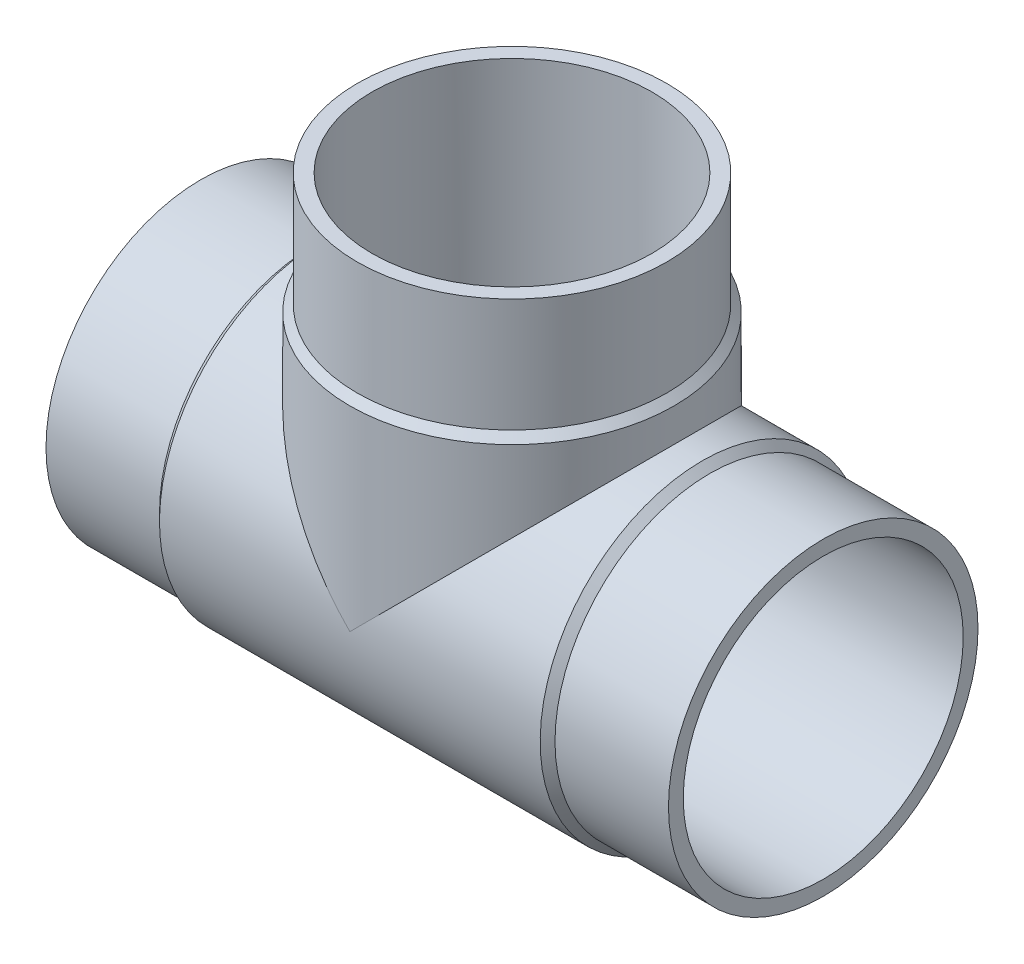
ISO-10303-21;
HEADER;
FILE_DESCRIPTION(('STEP AP214'),'2;1');
FILE_NAME('part.step','',(''),(''),'','','');
FILE_SCHEMA(('AUTOMOTIVE_DESIGN { 1 0 10303 214 1 1 1 1 }'));
ENDSEC;
DATA;
#1=APPLICATION_CONTEXT('core data for automotive mechanical design processes');
#2=APPLICATION_PROTOCOL_DEFINITION('international standard','automotive_design',2000,#1);
#3=PRODUCT_CONTEXT('',#1,'mechanical');
#4=PRODUCT('Part','Part','',(#3));
#5=PRODUCT_RELATED_PRODUCT_CATEGORY('part','',(#4));
#6=PRODUCT_DEFINITION_FORMATION('','',#4);
#7=PRODUCT_DEFINITION_CONTEXT('part definition',#1,'design');
#8=PRODUCT_DEFINITION('design','',#6,#7);
#9=PRODUCT_DEFINITION_SHAPE('','',#8);
#10=(LENGTH_UNIT() NAMED_UNIT(*) SI_UNIT(.MILLI.,.METRE.));
#11=(NAMED_UNIT(*) PLANE_ANGLE_UNIT() SI_UNIT($,.RADIAN.));
#12=(NAMED_UNIT(*) SI_UNIT($,.STERADIAN.) SOLID_ANGLE_UNIT());
#13=UNCERTAINTY_MEASURE_WITH_UNIT(LENGTH_MEASURE(1.E-05),#10,'distance_accuracy_value','');
#14=(GEOMETRIC_REPRESENTATION_CONTEXT(3) GLOBAL_UNCERTAINTY_ASSIGNED_CONTEXT((#13)) GLOBAL_UNIT_ASSIGNED_CONTEXT((#10,
#11,#12)) REPRESENTATION_CONTEXT('',''));
#15=CARTESIAN_POINT('',(0.,0.,0.));
#16=DIRECTION('',(0.,0.,1.));
#17=DIRECTION('',(1.,0.,0.));
#18=AXIS2_PLACEMENT_3D('',#15,#16,#17);
#19=CARTESIAN_POINT('',(-90.5,92.,0.));
#20=DIRECTION('',(0.,1.,0.));
#21=DIRECTION('',(0.,0.,1.));
#22=AXIS2_PLACEMENT_3D('',#19,#20,#21);
#23=CYLINDRICAL_SURFACE('',#22,45.);
#24=CARTESIAN_POINT('',(-90.5,92.,0.));
#25=DIRECTION('',(0.,1.,0.));
#26=DIRECTION('',(0.,0.,1.));
#27=AXIS2_PLACEMENT_3D('',#24,#25,#26);
#28=CIRCLE('',#27,45.);
#29=CARTESIAN_POINT('',(-90.5,92.,45.));
#30=VERTEX_POINT('',#29);
#31=EDGE_CURVE('E18',#30,#30,#28,.T.);
#32=ORIENTED_EDGE('',*,*,#31,.F.);
#33=EDGE_LOOP('',(#32));
#34=FACE_BOUND('',#33,.T.);
#35=CARTESIAN_POINT('',(-90.5,59.,0.));
#36=DIRECTION('',(0.,1.,0.));
#37=DIRECTION('',(1.,0.,0.));
#38=AXIS2_PLACEMENT_3D('',#35,#36,#37);
#39=CIRCLE('',#38,45.);
#40=CARTESIAN_POINT('',(-45.5,59.,0.));
#41=VERTEX_POINT('',#40);
#42=EDGE_CURVE('E71',#41,#41,#39,.F.);
#43=ORIENTED_EDGE('',*,*,#42,.F.);
#44=EDGE_LOOP('',(#43));
#45=FACE_BOUND('',#44,.T.);
#46=ADVANCED_FACE('F15',(#34,#45),#23,.T.);
#47=CARTESIAN_POINT('',(-90.5,59.,0.));
#48=DIRECTION('',(0.,-1.,0.));
#49=DIRECTION('',(0.,0.,-1.));
#50=AXIS2_PLACEMENT_3D('',#47,#48,#49);
#51=CONICAL_SURFACE('',#50,45.,0.785398163397448);
#52=CARTESIAN_POINT('',(-90.5,56.85,0.));
#53=DIRECTION('',(0.,1.,0.));
#54=DIRECTION('',(1.,0.,0.));
#55=AXIS2_PLACEMENT_3D('',#52,#53,#54);
#56=CIRCLE('',#55,47.15);
#57=CARTESIAN_POINT('',(-43.35,56.85,0.));
#58=VERTEX_POINT('',#57);
#59=EDGE_CURVE('E60',#58,#58,#56,.F.);
#60=ORIENTED_EDGE('',*,*,#59,.F.);
#61=EDGE_LOOP('',(#60));
#62=FACE_BOUND('',#61,.T.);
#63=ORIENTED_EDGE('',*,*,#42,.T.);
#64=EDGE_LOOP('',(#63));
#65=FACE_BOUND('',#64,.T.);
#66=ADVANCED_FACE('F141',(#62,#65),#51,.T.);
#67=CARTESIAN_POINT('',(-33.,0.,0.));
#68=DIRECTION('',(-1.,0.,0.));
#69=DIRECTION('',(0.,0.,1.));
#70=AXIS2_PLACEMENT_3D('',#67,#68,#69);
#71=CYLINDRICAL_SURFACE('',#70,45.);
#72=CARTESIAN_POINT('',(-33.,0.,0.));
#73=DIRECTION('',(1.,0.,0.));
#74=DIRECTION('',(0.,1.,0.));
#75=AXIS2_PLACEMENT_3D('',#72,#73,#74);
#76=CIRCLE('',#75,45.);
#77=CARTESIAN_POINT('',(-33.,45.,0.));
#78=VERTEX_POINT('',#77);
#79=EDGE_CURVE('E64',#78,#78,#76,.F.);
#80=ORIENTED_EDGE('',*,*,#79,.F.);
#81=EDGE_LOOP('',(#80));
#82=FACE_BOUND('',#81,.T.);
#83=CARTESIAN_POINT('',(0.,0.,0.));
#84=DIRECTION('',(-1.,0.,0.));
#85=DIRECTION('',(0.,0.,1.));
#86=AXIS2_PLACEMENT_3D('',#83,#84,#85);
#87=CIRCLE('',#86,45.);
#88=CARTESIAN_POINT('',(0.,0.,45.));
#89=VERTEX_POINT('',#88);
#90=EDGE_CURVE('E58',#89,#89,#87,.F.);
#91=ORIENTED_EDGE('',*,*,#90,.F.);
#92=EDGE_LOOP('',(#91));
#93=FACE_BOUND('',#92,.T.);
#94=ADVANCED_FACE('F136',(#82,#93),#71,.T.);
#95=CARTESIAN_POINT('',(-135.5,92.,45.540002108491));
#96=DIRECTION('',(0.,1.,0.));
#97=DIRECTION('',(1.,0.,0.));
#98=AXIS2_PLACEMENT_3D('',#95,#96,#97);
#99=PLANE('',#98);
#100=CARTESIAN_POINT('',(-90.5,92.,0.));
#101=DIRECTION('',(0.,1.,0.));
#102=DIRECTION('',(0.,0.,1.));
#103=AXIS2_PLACEMENT_3D('',#100,#101,#102);
#104=CIRCLE('',#103,40.7);
#105=CARTESIAN_POINT('',(-90.5,92.,40.7));
#106=VERTEX_POINT('',#105);
#107=EDGE_CURVE('E52',#106,#106,#104,.T.);
#108=ORIENTED_EDGE('',*,*,#107,.F.);
#109=EDGE_LOOP('',(#108));
#110=FACE_BOUND('',#109,.T.);
#111=ORIENTED_EDGE('',*,*,#31,.T.);
#112=EDGE_LOOP('',(#111));
#113=FACE_BOUND('',#112,.T.);
#114=ADVANCED_FACE('F130',(#110,#113),#99,.T.);
#115=CARTESIAN_POINT('',(-33.,0.,0.));
#116=DIRECTION('',(-1.,0.,0.));
#117=DIRECTION('',(0.,0.,1.));
#118=AXIS2_PLACEMENT_3D('',#115,#116,#117);
#119=CONICAL_SURFACE('',#118,45.,0.785398163397445);
#120=ORIENTED_EDGE('',*,*,#79,.T.);
#121=EDGE_LOOP('',(#120));
#122=FACE_BOUND('',#121,.T.);
#123=CARTESIAN_POINT('',(-35.15,0.,0.));
#124=DIRECTION('',(-1.,0.,0.));
#125=DIRECTION('',(0.,1.,0.));
#126=AXIS2_PLACEMENT_3D('',#123,#124,#125);
#127=CIRCLE('',#126,47.15);
#128=CARTESIAN_POINT('',(-35.15,47.15,0.));
#129=VERTEX_POINT('',#128);
#130=EDGE_CURVE('E49',#129,#129,#127,.T.);
#131=ORIENTED_EDGE('',*,*,#130,.F.);
#132=EDGE_LOOP('',(#131));
#133=FACE_BOUND('',#132,.T.);
#134=ADVANCED_FACE('F95',(#122,#133),#119,.T.);
#135=CARTESIAN_POINT('',(-90.5,56.85,0.));
#136=DIRECTION('',(0.,1.,0.));
#137=DIRECTION('',(0.,0.,1.));
#138=AXIS2_PLACEMENT_3D('',#135,#136,#137);
#139=CYLINDRICAL_SURFACE('',#138,47.15);
#140=CARTESIAN_POINT('',(-90.5,0.,0.));
#141=DIRECTION('',(0.707106781186547,0.707106781186547,0.));
#142=DIRECTION('',(-0.707106781186547,0.707106781186547,0.));
#143=AXIS2_PLACEMENT_3D('',#140,#141,#142);
#144=ELLIPSE('',#143,66.6801694658914,47.15);
#145=CARTESIAN_POINT('',(-90.5,0.,47.15));
#146=VERTEX_POINT('',#145);
#147=CARTESIAN_POINT('',(-90.5,0.,-47.15));
#148=VERTEX_POINT('',#147);
#149=EDGE_CURVE('E44',#146,#148,#144,.F.);
#150=ORIENTED_EDGE('',*,*,#149,.F.);
#151=CARTESIAN_POINT('',(-90.5,0.,0.));
#152=DIRECTION('',(-0.707106781186547,0.707106781186547,0.));
#153=DIRECTION('',(-0.707106781186547,-0.707106781186547,0.));
#154=AXIS2_PLACEMENT_3D('',#151,#152,#153);
#155=ELLIPSE('',#154,66.6801694658914,47.15);
#156=EDGE_CURVE('E40',#148,#146,#155,.F.);
#157=ORIENTED_EDGE('',*,*,#156,.F.);
#158=EDGE_LOOP('',(#150,#157));
#159=FACE_BOUND('',#158,.T.);
#160=ORIENTED_EDGE('',*,*,#59,.T.);
#161=EDGE_LOOP('',(#160));
#162=FACE_BOUND('',#161,.T.);
#163=ADVANCED_FACE('F47',(#159,#162),#139,.T.);
#164=CARTESIAN_POINT('',(0.,45.,45.5400021084165));
#165=DIRECTION('',(1.,0.,0.));
#166=DIRECTION('',(0.,-1.,0.));
#167=AXIS2_PLACEMENT_3D('',#164,#165,#166);
#168=PLANE('',#167);
#169=CARTESIAN_POINT('',(0.,0.,0.));
#170=DIRECTION('',(-1.,0.,0.));
#171=DIRECTION('',(0.,0.,1.));
#172=AXIS2_PLACEMENT_3D('',#169,#170,#171);
#173=CIRCLE('',#172,40.7);
#174=CARTESIAN_POINT('',(0.,0.,40.7));
#175=VERTEX_POINT('',#174);
#176=EDGE_CURVE('E45',#175,#175,#173,.F.);
#177=ORIENTED_EDGE('',*,*,#176,.F.);
#178=EDGE_LOOP('',(#177));
#179=FACE_BOUND('',#178,.T.);
#180=ORIENTED_EDGE('',*,*,#90,.T.);
#181=EDGE_LOOP('',(#180));
#182=FACE_BOUND('',#181,.T.);
#183=ADVANCED_FACE('F85',(#179,#182),#168,.T.);
#184=CARTESIAN_POINT('',(-90.5,0.,0.));
#185=DIRECTION('',(0.,1.,0.));
#186=DIRECTION('',(0.,0.,1.));
#187=AXIS2_PLACEMENT_3D('',#184,#185,#186);
#188=CYLINDRICAL_SURFACE('',#187,40.7);
#189=CARTESIAN_POINT('',(-90.5,0.,0.));
#190=DIRECTION('',(-0.707106781186547,-0.707106781186547,0.));
#191=DIRECTION('',(-0.707106781186547,0.707106781186547,0.));
#192=AXIS2_PLACEMENT_3D('',#189,#190,#191);
#193=ELLIPSE('',#192,57.558491988585,40.7);
#194=CARTESIAN_POINT('',(-90.5,0.,-40.7));
#195=VERTEX_POINT('',#194);
#196=CARTESIAN_POINT('',(-90.5,0.,40.7));
#197=VERTEX_POINT('',#196);
#198=EDGE_CURVE('E78',#195,#197,#193,.F.);
#199=ORIENTED_EDGE('',*,*,#198,.F.);
#200=CARTESIAN_POINT('',(-90.5,0.,0.));
#201=DIRECTION('',(-0.707106781186547,0.707106781186547,0.));
#202=DIRECTION('',(0.707106781186547,0.707106781186547,0.));
#203=AXIS2_PLACEMENT_3D('',#200,#201,#202);
#204=ELLIPSE('',#203,57.558491988585,40.7);
#205=EDGE_CURVE('E32',#195,#197,#204,.F.);
#206=ORIENTED_EDGE('',*,*,#205,.T.);
#207=EDGE_LOOP('',(#199,#206));
#208=FACE_BOUND('',#207,.T.);
#209=ORIENTED_EDGE('',*,*,#107,.T.);
#210=EDGE_LOOP('',(#209));
#211=FACE_BOUND('',#210,.T.);
#212=ADVANCED_FACE('F87',(#208,#211),#188,.F.);
#213=CARTESIAN_POINT('',(-145.85,0.,0.));
#214=DIRECTION('',(-1.,0.,0.));
#215=DIRECTION('',(0.,0.,1.));
#216=AXIS2_PLACEMENT_3D('',#213,#214,#215);
#217=CYLINDRICAL_SURFACE('',#216,47.15);
#218=ORIENTED_EDGE('',*,*,#130,.T.);
#219=EDGE_LOOP('',(#218));
#220=FACE_BOUND('',#219,.T.);
#221=CARTESIAN_POINT('',(-145.85,0.,0.));
#222=DIRECTION('',(-1.,0.,0.));
#223=DIRECTION('',(0.,1.,0.));
#224=AXIS2_PLACEMENT_3D('',#221,#222,#223);
#225=CIRCLE('',#224,47.15);
#226=CARTESIAN_POINT('',(-145.85,47.15,0.));
#227=VERTEX_POINT('',#226);
#228=EDGE_CURVE('E77',#227,#227,#225,.T.);
#229=ORIENTED_EDGE('',*,*,#228,.F.);
#230=EDGE_LOOP('',(#229));
#231=FACE_BOUND('',#230,.T.);
#232=ORIENTED_EDGE('',*,*,#149,.T.);
#233=ORIENTED_EDGE('',*,*,#156,.T.);
#234=EDGE_LOOP('',(#232,#233));
#235=FACE_BOUND('',#234,.T.);
#236=ADVANCED_FACE('F43',(#220,#231,#235),#217,.T.);
#237=CARTESIAN_POINT('',(-90.5,0.,0.));
#238=DIRECTION('',(-1.,0.,0.));
#239=DIRECTION('',(0.,0.,1.));
#240=AXIS2_PLACEMENT_3D('',#237,#238,#239);
#241=CYLINDRICAL_SURFACE('',#240,40.7);
#242=ORIENTED_EDGE('',*,*,#205,.F.);
#243=ORIENTED_EDGE('',*,*,#198,.T.);
#244=EDGE_LOOP('',(#242,#243));
#245=FACE_BOUND('',#244,.T.);
#246=ORIENTED_EDGE('',*,*,#176,.T.);
#247=EDGE_LOOP('',(#246));
#248=FACE_BOUND('',#247,.T.);
#249=CARTESIAN_POINT('',(-181.,0.,0.));
#250=DIRECTION('',(-1.,0.,0.));
#251=DIRECTION('',(0.,0.,1.));
#252=AXIS2_PLACEMENT_3D('',#249,#250,#251);
#253=CIRCLE('',#252,40.7);
#254=CARTESIAN_POINT('',(-181.,0.,40.7));
#255=VERTEX_POINT('',#254);
#256=EDGE_CURVE('E74',#255,#255,#253,.F.);
#257=ORIENTED_EDGE('',*,*,#256,.F.);
#258=EDGE_LOOP('',(#257));
#259=FACE_BOUND('',#258,.T.);
#260=ADVANCED_FACE('F82',(#245,#248,#259),#241,.F.);
#261=CARTESIAN_POINT('',(-148.,0.,0.));
#262=DIRECTION('',(1.,0.,0.));
#263=DIRECTION('',(0.,0.,-1.));
#264=AXIS2_PLACEMENT_3D('',#261,#262,#263);
#265=CONICAL_SURFACE('',#264,45.,0.785398163397453);
#266=ORIENTED_EDGE('',*,*,#228,.T.);
#267=EDGE_LOOP('',(#266));
#268=FACE_BOUND('',#267,.T.);
#269=CARTESIAN_POINT('',(-148.,0.,0.));
#270=DIRECTION('',(-1.,0.,0.));
#271=DIRECTION('',(0.,1.,0.));
#272=AXIS2_PLACEMENT_3D('',#269,#270,#271);
#273=CIRCLE('',#272,45.);
#274=CARTESIAN_POINT('',(-148.,45.,0.));
#275=VERTEX_POINT('',#274);
#276=EDGE_CURVE('E24',#275,#275,#273,.T.);
#277=ORIENTED_EDGE('',*,*,#276,.F.);
#278=EDGE_LOOP('',(#277));
#279=FACE_BOUND('',#278,.T.);
#280=ADVANCED_FACE('F105',(#268,#279),#265,.T.);
#281=CARTESIAN_POINT('',(-181.,-45.,45.5400021084174));
#282=DIRECTION('',(-1.,0.,0.));
#283=DIRECTION('',(0.,1.,0.));
#284=AXIS2_PLACEMENT_3D('',#281,#282,#283);
#285=PLANE('',#284);
#286=ORIENTED_EDGE('',*,*,#256,.T.);
#287=EDGE_LOOP('',(#286));
#288=FACE_BOUND('',#287,.T.);
#289=CARTESIAN_POINT('',(-181.,0.,0.));
#290=DIRECTION('',(-1.,0.,0.));
#291=DIRECTION('',(0.,0.,1.));
#292=AXIS2_PLACEMENT_3D('',#289,#290,#291);
#293=CIRCLE('',#292,45.);
#294=CARTESIAN_POINT('',(-181.,0.,45.));
#295=VERTEX_POINT('',#294);
#296=EDGE_CURVE('E9',#295,#295,#293,.F.);
#297=ORIENTED_EDGE('',*,*,#296,.F.);
#298=EDGE_LOOP('',(#297));
#299=FACE_BOUND('',#298,.T.);
#300=ADVANCED_FACE('F99',(#288,#299),#285,.T.);
#301=CARTESIAN_POINT('',(-181.,0.,0.));
#302=DIRECTION('',(-1.,0.,0.));
#303=DIRECTION('',(0.,0.,1.));
#304=AXIS2_PLACEMENT_3D('',#301,#302,#303);
#305=CYLINDRICAL_SURFACE('',#304,45.);
#306=ORIENTED_EDGE('',*,*,#276,.T.);
#307=EDGE_LOOP('',(#306));
#308=FACE_BOUND('',#307,.T.);
#309=ORIENTED_EDGE('',*,*,#296,.T.);
#310=EDGE_LOOP('',(#309));
#311=FACE_BOUND('',#310,.T.);
#312=ADVANCED_FACE('F97',(#308,#311),#305,.T.);
#313=CLOSED_SHELL('',(#46,#66,#94,#114,#134,#163,#183,#212,#236,#260,#280,#300,#312));
#314=MANIFOLD_SOLID_BREP('B1',#313);
#315=ADVANCED_BREP_SHAPE_REPRESENTATION('',(#18,#314),#14);
#316=SHAPE_DEFINITION_REPRESENTATION(#9,#315);
ENDSEC;
END-ISO-10303-21;
